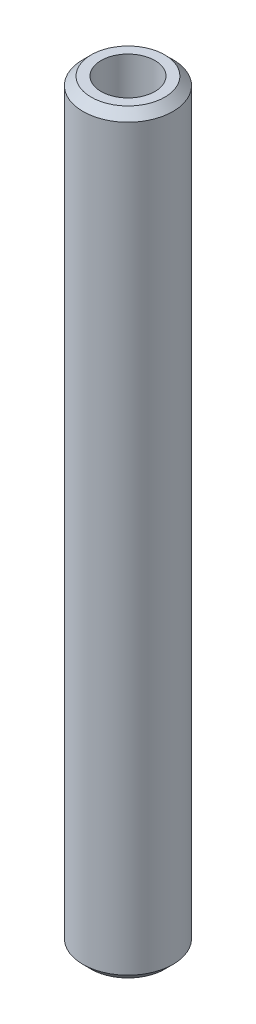
ISO-10303-21;
HEADER;
FILE_DESCRIPTION(('STEP AP214'),'2;1');
FILE_NAME('part.step','',(''),(''),'','','');
FILE_SCHEMA(('AUTOMOTIVE_DESIGN { 1 0 10303 214 1 1 1 1 }'));
ENDSEC;
DATA;
#1=APPLICATION_CONTEXT('core data for automotive mechanical design processes');
#2=APPLICATION_PROTOCOL_DEFINITION('international standard','automotive_design',2000,#1);
#3=PRODUCT_CONTEXT('',#1,'mechanical');
#4=PRODUCT('Part','Part','',(#3));
#5=PRODUCT_RELATED_PRODUCT_CATEGORY('part','',(#4));
#6=PRODUCT_DEFINITION_FORMATION('','',#4);
#7=PRODUCT_DEFINITION_CONTEXT('part definition',#1,'design');
#8=PRODUCT_DEFINITION('design','',#6,#7);
#9=PRODUCT_DEFINITION_SHAPE('','',#8);
#10=(LENGTH_UNIT() NAMED_UNIT(*) SI_UNIT(.MILLI.,.METRE.));
#11=(NAMED_UNIT(*) PLANE_ANGLE_UNIT() SI_UNIT($,.RADIAN.));
#12=(NAMED_UNIT(*) SI_UNIT($,.STERADIAN.) SOLID_ANGLE_UNIT());
#13=UNCERTAINTY_MEASURE_WITH_UNIT(LENGTH_MEASURE(1.E-05),#10,'distance_accuracy_value','');
#14=(GEOMETRIC_REPRESENTATION_CONTEXT(3) GLOBAL_UNCERTAINTY_ASSIGNED_CONTEXT((#13)) GLOBAL_UNIT_ASSIGNED_CONTEXT((#10,
#11,#12)) REPRESENTATION_CONTEXT('',''));
#15=CARTESIAN_POINT('',(0.,0.,0.));
#16=DIRECTION('',(0.,0.,1.));
#17=DIRECTION('',(1.,0.,0.));
#18=AXIS2_PLACEMENT_3D('',#15,#16,#17);
#19=CARTESIAN_POINT('',(0.,503.589973222027,0.));
#20=DIRECTION('',(0.,-1.,0.));
#21=DIRECTION('',(0.,0.,-1.));
#22=AXIS2_PLACEMENT_3D('',#19,#20,#21);
#23=CYLINDRICAL_SURFACE('',#22,30.);
#24=CARTESIAN_POINT('',(0.,498.090210489302,0.));
#25=DIRECTION('',(0.,1.,0.));
#26=DIRECTION('',(0.,0.,1.));
#27=AXIS2_PLACEMENT_3D('',#24,#25,#26);
#28=CIRCLE('',#27,30.);
#29=CARTESIAN_POINT('',(0.,498.090210489302,30.));
#30=VERTEX_POINT('',#29);
#31=EDGE_CURVE('E50',#30,#30,#28,.F.);
#32=ORIENTED_EDGE('',*,*,#31,.T.);
#33=EDGE_LOOP('',(#32));
#34=FACE_BOUND('',#33,.T.);
#35=CARTESIAN_POINT('',(0.,5.49976273272529,0.));
#36=DIRECTION('',(0.,1.,0.));
#37=DIRECTION('',(0.,0.,1.));
#38=AXIS2_PLACEMENT_3D('',#35,#36,#37);
#39=CIRCLE('',#38,30.);
#40=CARTESIAN_POINT('',(0.,5.49976273272529,30.));
#41=VERTEX_POINT('',#40);
#42=EDGE_CURVE('E51',#41,#41,#39,.T.);
#43=ORIENTED_EDGE('',*,*,#42,.T.);
#44=EDGE_LOOP('',(#43));
#45=FACE_BOUND('',#44,.T.);
#46=ADVANCED_FACE('F39',(#34,#45),#23,.T.);
#47=CARTESIAN_POINT('',(0.,503.589973222027,0.));
#48=DIRECTION('',(0.,1.,0.));
#49=DIRECTION('',(0.,0.,1.));
#50=AXIS2_PLACEMENT_3D('',#47,#48,#49);
#51=PLANE('',#50);
#52=CARTESIAN_POINT('',(0.,503.589973222027,0.));
#53=DIRECTION('',(0.,1.,0.));
#54=DIRECTION('',(0.,0.,1.));
#55=AXIS2_PLACEMENT_3D('',#52,#53,#54);
#56=CIRCLE('',#55,24.5002372672746);
#57=CARTESIAN_POINT('',(0.,503.589973222027,24.5002372672746));
#58=VERTEX_POINT('',#57);
#59=EDGE_CURVE('E54',#58,#58,#56,.T.);
#60=ORIENTED_EDGE('',*,*,#59,.T.);
#61=EDGE_LOOP('',(#60));
#62=FACE_BOUND('',#61,.T.);
#63=CARTESIAN_POINT('',(0.,503.589973222027,0.));
#64=DIRECTION('',(0.,1.,0.));
#65=DIRECTION('',(0.,0.,1.));
#66=AXIS2_PLACEMENT_3D('',#63,#64,#65);
#67=CIRCLE('',#66,17.9456068648495);
#68=CARTESIAN_POINT('',(0.,503.589973222027,17.9456068648495));
#69=VERTEX_POINT('',#68);
#70=EDGE_CURVE('E58',#69,#69,#67,.T.);
#71=ORIENTED_EDGE('',*,*,#70,.F.);
#72=EDGE_LOOP('',(#71));
#73=FACE_BOUND('',#72,.T.);
#74=ADVANCED_FACE('F69',(#62,#73),#51,.T.);
#75=CARTESIAN_POINT('',(0.,0.,0.));
#76=DIRECTION('',(0.,1.,0.));
#77=DIRECTION('',(0.,0.,1.));
#78=AXIS2_PLACEMENT_3D('',#75,#76,#77);
#79=PLANE('',#78);
#80=CARTESIAN_POINT('',(0.,0.,0.));
#81=DIRECTION('',(0.,1.,0.));
#82=DIRECTION('',(0.,0.,1.));
#83=AXIS2_PLACEMENT_3D('',#80,#81,#82);
#84=CIRCLE('',#83,24.5002372672747);
#85=CARTESIAN_POINT('',(0.,0.,24.5002372672747));
#86=VERTEX_POINT('',#85);
#87=EDGE_CURVE('E10',#86,#86,#84,.F.);
#88=ORIENTED_EDGE('',*,*,#87,.T.);
#89=EDGE_LOOP('',(#88));
#90=FACE_BOUND('',#89,.T.);
#91=CARTESIAN_POINT('',(0.,0.,0.));
#92=DIRECTION('',(0.,1.,0.));
#93=DIRECTION('',(0.,0.,1.));
#94=AXIS2_PLACEMENT_3D('',#91,#92,#93);
#95=CIRCLE('',#94,17.9456068648495);
#96=CARTESIAN_POINT('',(0.,0.,17.9456068648495));
#97=VERTEX_POINT('',#96);
#98=EDGE_CURVE('E63',#97,#97,#95,.T.);
#99=ORIENTED_EDGE('',*,*,#98,.T.);
#100=EDGE_LOOP('',(#99));
#101=FACE_BOUND('',#100,.T.);
#102=ADVANCED_FACE('F75',(#90,#101),#79,.F.);
#103=CARTESIAN_POINT('',(0.,503.589973222027,0.));
#104=DIRECTION('',(0.,-1.,0.));
#105=DIRECTION('',(0.,0.,-1.));
#106=AXIS2_PLACEMENT_3D('',#103,#104,#105);
#107=CYLINDRICAL_SURFACE('',#106,17.9456068648495);
#108=ORIENTED_EDGE('',*,*,#70,.T.);
#109=EDGE_LOOP('',(#108));
#110=FACE_BOUND('',#109,.T.);
#111=ORIENTED_EDGE('',*,*,#98,.F.);
#112=EDGE_LOOP('',(#111));
#113=FACE_BOUND('',#112,.T.);
#114=ADVANCED_FACE('F70',(#110,#113),#107,.F.);
#115=CARTESIAN_POINT('',(0.,503.589973222027,0.));
#116=DIRECTION('',(0.,-1.,0.));
#117=DIRECTION('',(0.,0.,-1.));
#118=AXIS2_PLACEMENT_3D('',#115,#116,#117);
#119=CONICAL_SURFACE('',#118,24.5002372672746,0.785398163397451);
#120=ORIENTED_EDGE('',*,*,#31,.F.);
#121=EDGE_LOOP('',(#120));
#122=FACE_BOUND('',#121,.T.);
#123=ORIENTED_EDGE('',*,*,#59,.F.);
#124=EDGE_LOOP('',(#123));
#125=FACE_BOUND('',#124,.T.);
#126=ADVANCED_FACE('F81',(#122,#125),#119,.T.);
#127=CARTESIAN_POINT('',(0.,5.49976273272529,0.));
#128=DIRECTION('',(0.,1.,0.));
#129=DIRECTION('',(0.,0.,1.));
#130=AXIS2_PLACEMENT_3D('',#127,#128,#129);
#131=CONICAL_SURFACE('',#130,30.,0.785398163397451);
#132=CARTESIAN_POINT('',(0.,0.,24.5002372672747));
#133=CARTESIAN_POINT('',(0.,0.0572891951325546,24.5575264624072));
#134=CARTESIAN_POINT('',(0.,0.11457839026511,24.6148156575398));
#135=CARTESIAN_POINT('',(0.,0.22915678053022,24.7293940478049));
#136=CARTESIAN_POINT('',(0.,0.286445975662775,24.7866832429375));
#137=CARTESIAN_POINT('',(0.,0.401024365927885,24.9012616332026));
#138=CARTESIAN_POINT('',(0.,0.458313561060439,24.9585508283351));
#139=CARTESIAN_POINT('',(0.,0.57289195132555,25.0731292186002));
#140=CARTESIAN_POINT('',(0.,0.630181146458105,25.1304184137328));
#141=CARTESIAN_POINT('',(0.,0.744759536723216,25.2449968039979));
#142=CARTESIAN_POINT('',(0.,0.802048731855771,25.3022859991305));
#143=CARTESIAN_POINT('',(0.,0.91662712212088,25.4168643893956));
#144=CARTESIAN_POINT('',(0.,0.973916317253436,25.4741535845281));
#145=CARTESIAN_POINT('',(0.,1.08849470751855,25.5887319747932));
#146=CARTESIAN_POINT('',(0.,1.1457839026511,25.6460211699258));
#147=CARTESIAN_POINT('',(0.,1.26036229291621,25.7605995601909));
#148=CARTESIAN_POINT('',(0.,1.31765148804877,25.8178887553235));
#149=CARTESIAN_POINT('',(0.,1.43222987831388,25.9324671455886));
#150=CARTESIAN_POINT('',(0.,1.48951907344643,25.9897563407211));
#151=CARTESIAN_POINT('',(0.,1.60409746371154,26.1043347309862));
#152=CARTESIAN_POINT('',(0.,1.6613866588441,26.1616239261188));
#153=CARTESIAN_POINT('',(0.,1.77596504910921,26.2762023163839));
#154=CARTESIAN_POINT('',(0.,1.83325424424176,26.3334915115165));
#155=CARTESIAN_POINT('',(0.,1.94783263450687,26.4480699017816));
#156=CARTESIAN_POINT('',(0.,2.00512182963943,26.5053590969141));
#157=CARTESIAN_POINT('',(0.,2.11970021990454,26.6199374871792));
#158=CARTESIAN_POINT('',(0.,2.17698941503709,26.6772266823118));
#159=CARTESIAN_POINT('',(0.,2.2915678053022,26.7918050725769));
#160=CARTESIAN_POINT('',(0.,2.34885700043476,26.8490942677095));
#161=CARTESIAN_POINT('',(0.,2.46343539069987,26.9636726579746));
#162=CARTESIAN_POINT('',(0.,2.52072458583242,27.0209618531071));
#163=CARTESIAN_POINT('',(0.,2.63530297609753,27.1355402433722));
#164=CARTESIAN_POINT('',(0.,2.69259217123009,27.1928294385048));
#165=CARTESIAN_POINT('',(0.,2.8071705614952,27.3074078287699));
#166=CARTESIAN_POINT('',(0.,2.86445975662775,27.3646970239025));
#167=CARTESIAN_POINT('',(0.,2.97903814689286,27.4792754141676));
#168=CARTESIAN_POINT('',(0.,3.03632734202542,27.5365646093001));
#169=CARTESIAN_POINT('',(0.,3.15090573229053,27.6511429995652));
#170=CARTESIAN_POINT('',(0.,3.20819492742308,27.7084321946978));
#171=CARTESIAN_POINT('',(0.,3.32277331768819,27.8230105849629));
#172=CARTESIAN_POINT('',(0.,3.38006251282075,27.8802997800955));
#173=CARTESIAN_POINT('',(0.,3.49464090308586,27.9948781703606));
#174=CARTESIAN_POINT('',(0.,3.55193009821841,28.0521673654931));
#175=CARTESIAN_POINT('',(0.,3.66650848848353,28.1667457557582));
#176=CARTESIAN_POINT('',(0.,3.72379768361608,28.2240349508908));
#177=CARTESIAN_POINT('',(0.,3.83837607388119,28.3386133411559));
#178=CARTESIAN_POINT('',(0.,3.89566526901375,28.3959025362884));
#179=CARTESIAN_POINT('',(0.,4.01024365927886,28.5104809265536));
#180=CARTESIAN_POINT('',(0.,4.06753285441141,28.5677701216861));
#181=CARTESIAN_POINT('',(0.,4.18211124467652,28.6823485119512));
#182=CARTESIAN_POINT('',(0.,4.23940043980908,28.7396377070838));
#183=CARTESIAN_POINT('',(0.,4.35397883007419,28.8542160973489));
#184=CARTESIAN_POINT('',(0.,4.41126802520674,28.9115052924814));
#185=CARTESIAN_POINT('',(0.,4.52584641547185,29.0260836827466));
#186=CARTESIAN_POINT('',(0.,4.58313561060441,29.0833728778791));
#187=CARTESIAN_POINT('',(0.,4.69771400086952,29.1979512681442));
#188=CARTESIAN_POINT('',(0.,4.75500319600207,29.2552404632768));
#189=CARTESIAN_POINT('',(0.,4.86958158626718,29.3698188535419));
#190=CARTESIAN_POINT('',(0.,4.92687078139974,29.4271080486744));
#191=CARTESIAN_POINT('',(0.,5.04144917166485,29.5416864389396));
#192=CARTESIAN_POINT('',(0.,5.0987383667974,29.5989756340721));
#193=CARTESIAN_POINT('',(0.,5.21331675706251,29.7135540243372));
#194=CARTESIAN_POINT('',(0.,5.27060595219507,29.7708432194698));
#195=CARTESIAN_POINT('',(0.,5.38518434246018,29.8854216097349));
#196=CARTESIAN_POINT('',(0.,5.44247353759273,29.9427108048674));
#197=CARTESIAN_POINT('',(0.,5.49976273272529,30.));
#198=B_SPLINE_CURVE_WITH_KNOTS('',3,(#132,#133,#134,#135,#136,#137,#138,#139,#140,#141,#142,
#143,#144,#145,#146,#147,#148,#149,#150,#151,#152,#153,#154,#155,#156,#157,#158,#159,#160,#161,
#162,#163,#164,#165,#166,#167,#168,#169,#170,#171,#172,#173,#174,#175,#176,#177,#178,#179,#180,
#181,#182,#183,#184,#185,#186,#187,#188,#189,#190,#191,#192,#193,#194,#195,#196,#197),
.UNSPECIFIED.,.F.,.F.,(4,2,2,2,2,2,2,2,2,2,2,2,2,2,2,2,2,2,2,2,2,2,2,2,2,2,2,2,2,2,2,2,4),(0.,
0.243057470201693,0.486114940403389,0.729172410605084,0.972229880806777,1.21528735100847,
1.45834482121017,1.70140229141186,1.94445976161356,2.18751723181525,2.43057470201695,
2.67363217221864,2.91668964242034,3.15974711262203,3.40280458282373,3.64586205302542,
3.88891952322712,4.13197699342881,4.37503446363051,4.6180919338322,4.8611494040339,
5.10420687423559,5.34726434443729,5.59032181463898,5.83337928484068,6.07643675504238,
6.31949422524407,6.56255169544576,6.80560916564746,7.04866663584915,7.29172410605085,
7.53478157625254,7.77783904645424),.UNSPECIFIED.);
#199=EDGE_CURVE('BSEAM45',#86,#41,#198,.T.);
#200=ORIENTED_EDGE('',*,*,#87,.F.);
#201=ORIENTED_EDGE('',*,*,#42,.F.);
#202=ORIENTED_EDGE('',*,*,#199,.T.);
#203=ORIENTED_EDGE('',*,*,#199,.F.);
#204=EDGE_LOOP('',(#200,#202,#201,#203));
#205=FACE_BOUND('',#204,.T.);
#206=ADVANCED_FACE('F45',(#205),#131,.T.);
#207=CLOSED_SHELL('',(#46,#74,#102,#114,#126,#206));
#208=MANIFOLD_SOLID_BREP('B2',#207);
#209=ADVANCED_BREP_SHAPE_REPRESENTATION('',(#18,#208),#14);
#210=SHAPE_DEFINITION_REPRESENTATION(#9,#209);
ENDSEC;
END-ISO-10303-21;
